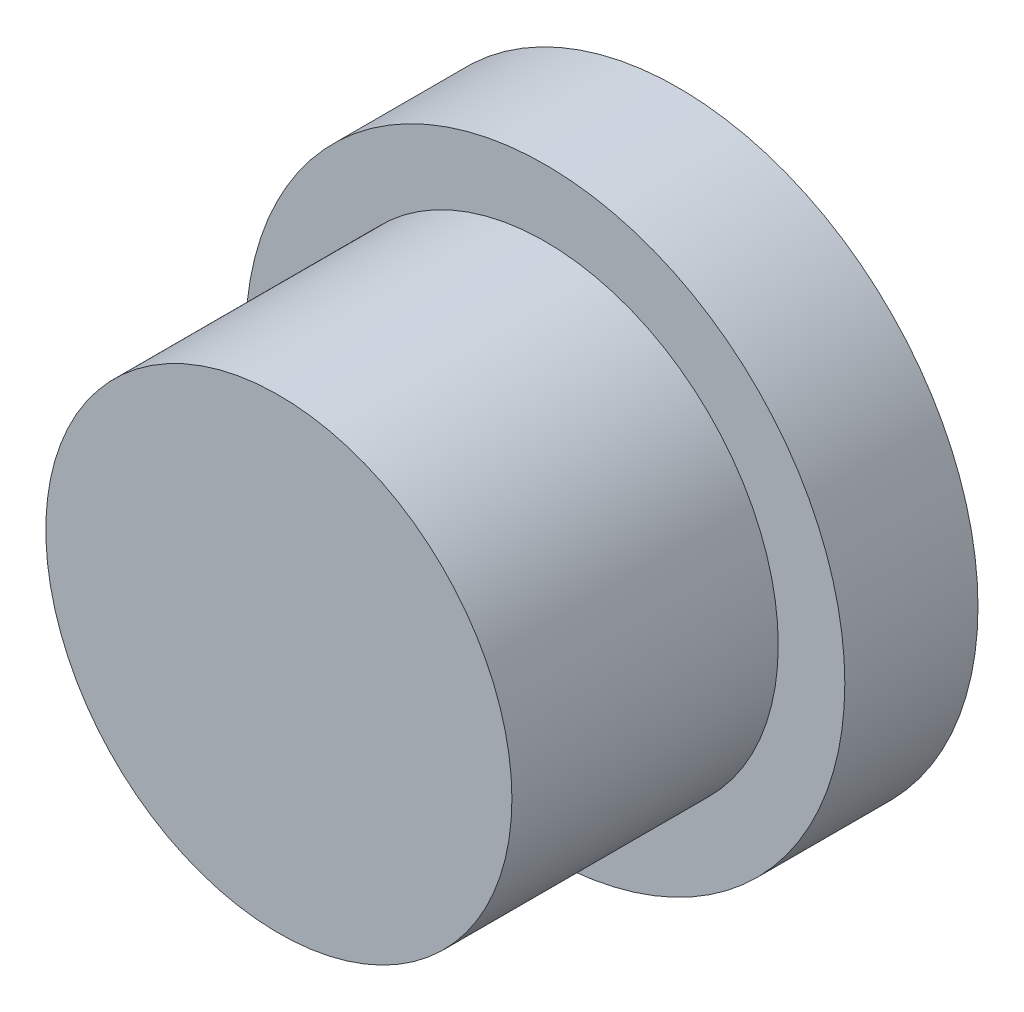
ISO-10303-21;
HEADER;
FILE_DESCRIPTION(('STEP AP214'),'2;1');
FILE_NAME('part.step','',(''),(''),'','','');
FILE_SCHEMA(('AUTOMOTIVE_DESIGN { 1 0 10303 214 1 1 1 1 }'));
ENDSEC;
DATA;
#1=APPLICATION_CONTEXT('core data for automotive mechanical design processes');
#2=APPLICATION_PROTOCOL_DEFINITION('international standard','automotive_design',2000,#1);
#3=PRODUCT_CONTEXT('',#1,'mechanical');
#4=PRODUCT('Part','Part','',(#3));
#5=PRODUCT_RELATED_PRODUCT_CATEGORY('part','',(#4));
#6=PRODUCT_DEFINITION_FORMATION('','',#4);
#7=PRODUCT_DEFINITION_CONTEXT('part definition',#1,'design');
#8=PRODUCT_DEFINITION('design','',#6,#7);
#9=PRODUCT_DEFINITION_SHAPE('','',#8);
#10=(LENGTH_UNIT() NAMED_UNIT(*) SI_UNIT(.MILLI.,.METRE.));
#11=(NAMED_UNIT(*) PLANE_ANGLE_UNIT() SI_UNIT($,.RADIAN.));
#12=(NAMED_UNIT(*) SI_UNIT($,.STERADIAN.) SOLID_ANGLE_UNIT());
#13=UNCERTAINTY_MEASURE_WITH_UNIT(LENGTH_MEASURE(1.E-05),#10,'distance_accuracy_value','');
#14=(GEOMETRIC_REPRESENTATION_CONTEXT(3) GLOBAL_UNCERTAINTY_ASSIGNED_CONTEXT((#13)) GLOBAL_UNIT_ASSIGNED_CONTEXT((#10,
#11,#12)) REPRESENTATION_CONTEXT('',''));
#15=CARTESIAN_POINT('',(0.,0.,0.));
#16=DIRECTION('',(0.,0.,1.));
#17=DIRECTION('',(1.,0.,0.));
#18=AXIS2_PLACEMENT_3D('',#15,#16,#17);
#19=CARTESIAN_POINT('',(0.,0.,2.));
#20=DIRECTION('',(0.,0.,-1.));
#21=DIRECTION('',(-1.,0.,0.));
#22=AXIS2_PLACEMENT_3D('',#19,#20,#21);
#23=CYLINDRICAL_SURFACE('',#22,4.5);
#24=CARTESIAN_POINT('',(0.,0.,2.));
#25=DIRECTION('',(0.,0.,1.));
#26=DIRECTION('',(1.,0.,0.));
#27=AXIS2_PLACEMENT_3D('',#24,#25,#26);
#28=CIRCLE('',#27,4.5);
#29=CARTESIAN_POINT('',(4.5,0.,2.));
#30=VERTEX_POINT('',#29);
#31=EDGE_CURVE('E38',#30,#30,#28,.T.);
#32=ORIENTED_EDGE('',*,*,#31,.F.);
#33=EDGE_LOOP('',(#32));
#34=FACE_BOUND('',#33,.T.);
#35=CARTESIAN_POINT('',(0.,0.,0.));
#36=DIRECTION('',(0.,0.,1.));
#37=DIRECTION('',(1.,0.,0.));
#38=AXIS2_PLACEMENT_3D('',#35,#36,#37);
#39=CIRCLE('',#38,4.5);
#40=CARTESIAN_POINT('',(4.5,0.,0.));
#41=VERTEX_POINT('',#40);
#42=EDGE_CURVE('E34',#41,#41,#39,.T.);
#43=ORIENTED_EDGE('',*,*,#42,.T.);
#44=EDGE_LOOP('',(#43));
#45=FACE_BOUND('',#44,.T.);
#46=ADVANCED_FACE('F31',(#34,#45),#23,.T.);
#47=CARTESIAN_POINT('',(0.,0.,2.));
#48=DIRECTION('',(0.,0.,1.));
#49=DIRECTION('',(1.,0.,0.));
#50=AXIS2_PLACEMENT_3D('',#47,#48,#49);
#51=PLANE('',#50);
#52=CARTESIAN_POINT('',(0.,0.,2.));
#53=DIRECTION('',(0.,0.,1.));
#54=DIRECTION('',(1.,0.,0.));
#55=AXIS2_PLACEMENT_3D('',#52,#53,#54);
#56=CIRCLE('',#55,3.5);
#57=CARTESIAN_POINT('',(3.5,0.,2.));
#58=VERTEX_POINT('',#57);
#59=EDGE_CURVE('E10',#58,#58,#56,.T.);
#60=ORIENTED_EDGE('',*,*,#59,.F.);
#61=EDGE_LOOP('',(#60));
#62=FACE_BOUND('',#61,.T.);
#63=ORIENTED_EDGE('',*,*,#31,.T.);
#64=EDGE_LOOP('',(#63));
#65=FACE_BOUND('',#64,.T.);
#66=ADVANCED_FACE('F67',(#62,#65),#51,.T.);
#67=CARTESIAN_POINT('',(0.,0.,0.));
#68=DIRECTION('',(0.,0.,1.));
#69=DIRECTION('',(1.,0.,0.));
#70=AXIS2_PLACEMENT_3D('',#67,#68,#69);
#71=PLANE('',#70);
#72=CARTESIAN_POINT('',(0.,0.,0.));
#73=DIRECTION('',(0.,0.,-1.));
#74=DIRECTION('',(-1.,0.,0.));
#75=AXIS2_PLACEMENT_3D('',#72,#73,#74);
#76=CIRCLE('',#75,2.5);
#77=CARTESIAN_POINT('',(-2.5,0.,0.));
#78=VERTEX_POINT('',#77);
#79=EDGE_CURVE('E48',#78,#78,#76,.T.);
#80=ORIENTED_EDGE('',*,*,#79,.F.);
#81=EDGE_LOOP('',(#80));
#82=FACE_BOUND('',#81,.T.);
#83=ORIENTED_EDGE('',*,*,#42,.F.);
#84=EDGE_LOOP('',(#83));
#85=FACE_BOUND('',#84,.T.);
#86=ADVANCED_FACE('F63',(#82,#85),#71,.F.);
#87=CARTESIAN_POINT('',(0.,0.,6.));
#88=DIRECTION('',(0.,0.,-1.));
#89=DIRECTION('',(-1.,0.,0.));
#90=AXIS2_PLACEMENT_3D('',#87,#88,#89);
#91=CYLINDRICAL_SURFACE('',#90,3.5);
#92=CARTESIAN_POINT('',(0.,0.,6.));
#93=DIRECTION('',(0.,0.,1.));
#94=DIRECTION('',(1.,0.,0.));
#95=AXIS2_PLACEMENT_3D('',#92,#93,#94);
#96=CIRCLE('',#95,3.5);
#97=CARTESIAN_POINT('',(3.5,0.,6.));
#98=VERTEX_POINT('',#97);
#99=EDGE_CURVE('E44',#98,#98,#96,.T.);
#100=ORIENTED_EDGE('',*,*,#99,.F.);
#101=EDGE_LOOP('',(#100));
#102=FACE_BOUND('',#101,.T.);
#103=ORIENTED_EDGE('',*,*,#59,.T.);
#104=EDGE_LOOP('',(#103));
#105=FACE_BOUND('',#104,.T.);
#106=ADVANCED_FACE('F66',(#102,#105),#91,.T.);
#107=CARTESIAN_POINT('',(0.,0.,6.));
#108=DIRECTION('',(0.,0.,1.));
#109=DIRECTION('',(1.,0.,0.));
#110=AXIS2_PLACEMENT_3D('',#107,#108,#109);
#111=PLANE('',#110);
#112=ORIENTED_EDGE('',*,*,#99,.T.);
#113=EDGE_LOOP('',(#112));
#114=FACE_BOUND('',#113,.T.);
#115=ADVANCED_FACE('F59',(#114),#111,.T.);
#116=CARTESIAN_POINT('',(0.,0.,5.));
#117=DIRECTION('',(0.,0.,-1.));
#118=DIRECTION('',(-1.,0.,0.));
#119=AXIS2_PLACEMENT_3D('',#116,#117,#118);
#120=CYLINDRICAL_SURFACE('',#119,2.5);
#121=CARTESIAN_POINT('',(0.,0.,5.));
#122=DIRECTION('',(0.,0.,-1.));
#123=DIRECTION('',(-1.,0.,0.));
#124=AXIS2_PLACEMENT_3D('',#121,#122,#123);
#125=CIRCLE('',#124,2.5);
#126=CARTESIAN_POINT('',(-2.5,0.,5.));
#127=VERTEX_POINT('',#126);
#128=EDGE_CURVE('E47',#127,#127,#125,.T.);
#129=ORIENTED_EDGE('',*,*,#128,.F.);
#130=EDGE_LOOP('',(#129));
#131=FACE_BOUND('',#130,.T.);
#132=ORIENTED_EDGE('',*,*,#79,.T.);
#133=EDGE_LOOP('',(#132));
#134=FACE_BOUND('',#133,.T.);
#135=ADVANCED_FACE('F56',(#131,#134),#120,.F.);
#136=CARTESIAN_POINT('',(0.,0.,5.));
#137=DIRECTION('',(0.,0.,-1.));
#138=DIRECTION('',(-1.,0.,0.));
#139=AXIS2_PLACEMENT_3D('',#136,#137,#138);
#140=PLANE('',#139);
#141=ORIENTED_EDGE('',*,*,#128,.T.);
#142=EDGE_LOOP('',(#141));
#143=FACE_BOUND('',#142,.T.);
#144=ADVANCED_FACE('F54',(#143),#140,.T.);
#145=CLOSED_SHELL('',(#46,#66,#86,#106,#115,#135,#144));
#146=MANIFOLD_SOLID_BREP('B2',#145);
#147=ADVANCED_BREP_SHAPE_REPRESENTATION('',(#18,#146),#14);
#148=SHAPE_DEFINITION_REPRESENTATION(#9,#147);
ENDSEC;
END-ISO-10303-21;
